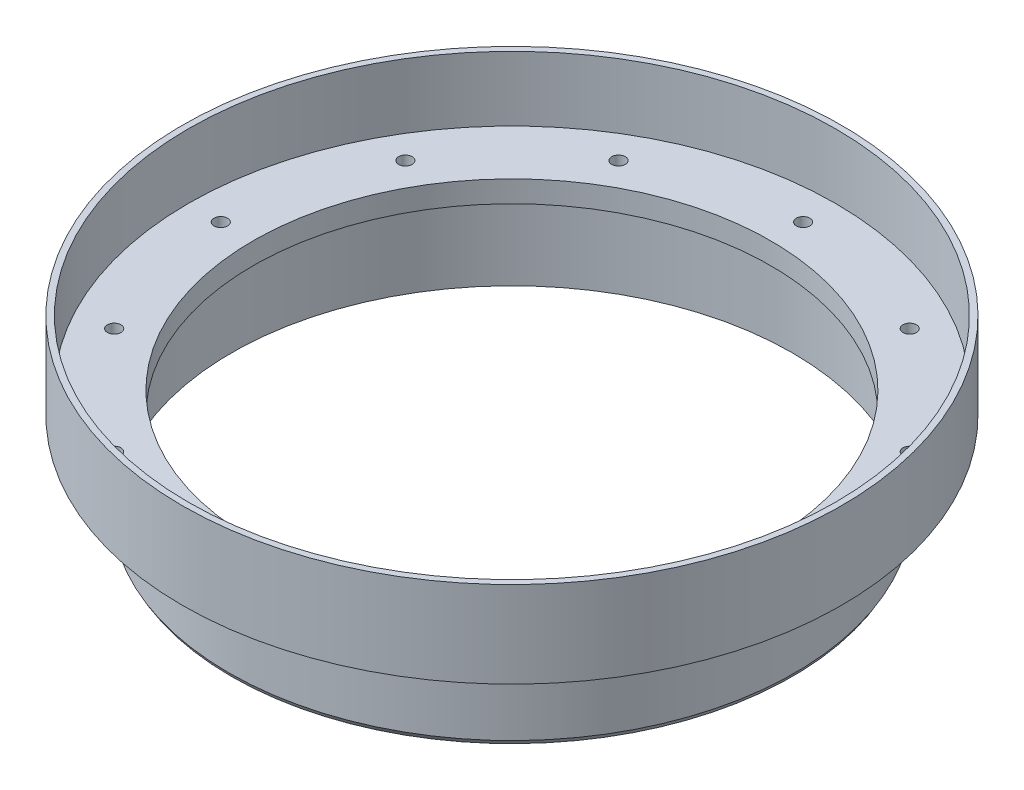
ISO-10303-21;
HEADER;
FILE_DESCRIPTION(('STEP AP214'),'2;1');
FILE_NAME('part.step','',(''),(''),'','','');
FILE_SCHEMA(('AUTOMOTIVE_DESIGN { 1 0 10303 214 1 1 1 1 }'));
ENDSEC;
DATA;
#1=APPLICATION_CONTEXT('core data for automotive mechanical design processes');
#2=APPLICATION_PROTOCOL_DEFINITION('international standard','automotive_design',2000,#1);
#3=PRODUCT_CONTEXT('',#1,'mechanical');
#4=PRODUCT('Part','Part','',(#3));
#5=PRODUCT_RELATED_PRODUCT_CATEGORY('part','',(#4));
#6=PRODUCT_DEFINITION_FORMATION('','',#4);
#7=PRODUCT_DEFINITION_CONTEXT('part definition',#1,'design');
#8=PRODUCT_DEFINITION('design','',#6,#7);
#9=PRODUCT_DEFINITION_SHAPE('','',#8);
#10=(LENGTH_UNIT() NAMED_UNIT(*) SI_UNIT(.MILLI.,.METRE.));
#11=(NAMED_UNIT(*) PLANE_ANGLE_UNIT() SI_UNIT($,.RADIAN.));
#12=(NAMED_UNIT(*) SI_UNIT($,.STERADIAN.) SOLID_ANGLE_UNIT());
#13=UNCERTAINTY_MEASURE_WITH_UNIT(LENGTH_MEASURE(1.E-05),#10,'distance_accuracy_value','');
#14=(GEOMETRIC_REPRESENTATION_CONTEXT(3) GLOBAL_UNCERTAINTY_ASSIGNED_CONTEXT((#13)) GLOBAL_UNIT_ASSIGNED_CONTEXT((#10,
#11,#12)) REPRESENTATION_CONTEXT('',''));
#15=CARTESIAN_POINT('',(0.,0.,0.));
#16=DIRECTION('',(0.,0.,1.));
#17=DIRECTION('',(1.,0.,0.));
#18=AXIS2_PLACEMENT_3D('',#15,#16,#17);
#19=CARTESIAN_POINT('',(-47.625,0.,0.));
#20=DIRECTION('',(0.,1.,0.));
#21=DIRECTION('',(0.,0.,1.));
#22=AXIS2_PLACEMENT_3D('',#19,#20,#21);
#23=PLANE('',#22);
#24=CARTESIAN_POINT('',(-37.1200138697107,0.,21.4312499999996));
#25=DIRECTION('',(0.,1.,0.));
#26=DIRECTION('',(0.,0.,1.));
#27=AXIS2_PLACEMENT_3D('',#24,#25,#26);
#28=CIRCLE('',#27,0.996949999999996);
#29=CARTESIAN_POINT('',(-37.1200138697107,0.,22.4281999999996));
#30=VERTEX_POINT('',#29);
#31=EDGE_CURVE('E143',#30,#30,#28,.T.);
#32=ORIENTED_EDGE('',*,*,#31,.F.);
#33=EDGE_LOOP('',(#32));
#34=FACE_BOUND('',#33,.T.);
#35=CARTESIAN_POINT('',(-21.4312500000004,0.,37.1200138697103));
#36=DIRECTION('',(0.,1.,0.));
#37=DIRECTION('',(0.,0.,1.));
#38=AXIS2_PLACEMENT_3D('',#35,#36,#37);
#39=CIRCLE('',#38,0.99695);
#40=CARTESIAN_POINT('',(-21.4312500000004,0.,38.1169638697103));
#41=VERTEX_POINT('',#40);
#42=EDGE_CURVE('E147',#41,#41,#39,.T.);
#43=ORIENTED_EDGE('',*,*,#42,.F.);
#44=EDGE_LOOP('',(#43));
#45=FACE_BOUND('',#44,.T.);
#46=CARTESIAN_POINT('',(-3.67572619286853E-13,0.,42.8625));
#47=DIRECTION('',(0.,1.,0.));
#48=DIRECTION('',(0.,0.,1.));
#49=AXIS2_PLACEMENT_3D('',#46,#47,#48);
#50=CIRCLE('',#49,0.996949999999999);
#51=CARTESIAN_POINT('',(-3.67572619286853E-13,0.,43.85945));
#52=VERTEX_POINT('',#51);
#53=EDGE_CURVE('E151',#52,#52,#50,.T.);
#54=ORIENTED_EDGE('',*,*,#53,.F.);
#55=EDGE_LOOP('',(#54));
#56=FACE_BOUND('',#55,.T.);
#57=CARTESIAN_POINT('',(21.4312499999997,0.,37.1200138697107));
#58=DIRECTION('',(0.,1.,0.));
#59=DIRECTION('',(0.,0.,1.));
#60=AXIS2_PLACEMENT_3D('',#57,#58,#59);
#61=CIRCLE('',#60,0.99695);
#62=CARTESIAN_POINT('',(21.4312499999997,0.,38.1169638697107));
#63=VERTEX_POINT('',#62);
#64=EDGE_CURVE('E155',#63,#63,#61,.T.);
#65=ORIENTED_EDGE('',*,*,#64,.F.);
#66=EDGE_LOOP('',(#65));
#67=FACE_BOUND('',#66,.T.);
#68=CARTESIAN_POINT('',(37.1200138697104,0.,21.4312500000002));
#69=DIRECTION('',(0.,1.,0.));
#70=DIRECTION('',(0.,0.,1.));
#71=AXIS2_PLACEMENT_3D('',#68,#69,#70);
#72=CIRCLE('',#71,0.996949999999996);
#73=CARTESIAN_POINT('',(37.1200138697104,0.,22.4282000000002));
#74=VERTEX_POINT('',#73);
#75=EDGE_CURVE('E159',#74,#74,#72,.T.);
#76=ORIENTED_EDGE('',*,*,#75,.F.);
#77=EDGE_LOOP('',(#76));
#78=FACE_BOUND('',#77,.T.);
#79=CARTESIAN_POINT('',(42.8625,0.,2.36953774157887E-13));
#80=DIRECTION('',(0.,1.,0.));
#81=DIRECTION('',(0.,0.,1.));
#82=AXIS2_PLACEMENT_3D('',#79,#80,#81);
#83=CIRCLE('',#82,0.996949999999996);
#84=CARTESIAN_POINT('',(42.8625,0.,0.996950000000233));
#85=VERTEX_POINT('',#84);
#86=EDGE_CURVE('E85',#85,#85,#83,.T.);
#87=ORIENTED_EDGE('',*,*,#86,.F.);
#88=EDGE_LOOP('',(#87));
#89=FACE_BOUND('',#88,.T.);
#90=CARTESIAN_POINT('',(37.1200138697106,0.,-21.4312499999998));
#91=DIRECTION('',(0.,1.,0.));
#92=DIRECTION('',(0.,0.,1.));
#93=AXIS2_PLACEMENT_3D('',#90,#91,#92);
#94=CIRCLE('',#93,0.996949999999996);
#95=CARTESIAN_POINT('',(37.1200138697106,0.,-20.4342999999998));
#96=VERTEX_POINT('',#95);
#97=EDGE_CURVE('E74',#96,#96,#94,.T.);
#98=ORIENTED_EDGE('',*,*,#97,.F.);
#99=EDGE_LOOP('',(#98));
#100=FACE_BOUND('',#99,.T.);
#101=CARTESIAN_POINT('',(21.4312500000001,0.,-37.1200138697104));
#102=DIRECTION('',(0.,1.,0.));
#103=DIRECTION('',(0.,0.,1.));
#104=AXIS2_PLACEMENT_3D('',#101,#102,#103);
#105=CIRCLE('',#104,0.99695);
#106=CARTESIAN_POINT('',(21.4312500000001,0.,-36.1230638697104));
#107=VERTEX_POINT('',#106);
#108=EDGE_CURVE('E71',#107,#107,#105,.T.);
#109=ORIENTED_EDGE('',*,*,#108,.F.);
#110=EDGE_LOOP('',(#109));
#111=FACE_BOUND('',#110,.T.);
#112=CARTESIAN_POINT('',(1.15852315907521E-13,0.,-42.8625));
#113=DIRECTION('',(0.,1.,0.));
#114=DIRECTION('',(0.,0.,1.));
#115=AXIS2_PLACEMENT_3D('',#112,#113,#114);
#116=CIRCLE('',#115,0.996949999999999);
#117=CARTESIAN_POINT('',(1.15852315907521E-13,0.,-41.86555));
#118=VERTEX_POINT('',#117);
#119=EDGE_CURVE('E70',#118,#118,#116,.T.);
#120=ORIENTED_EDGE('',*,*,#119,.F.);
#121=EDGE_LOOP('',(#120));
#122=FACE_BOUND('',#121,.T.);
#123=CARTESIAN_POINT('',(-21.4312499999999,0.,-37.1200138697105));
#124=DIRECTION('',(0.,1.,0.));
#125=DIRECTION('',(0.,0.,1.));
#126=AXIS2_PLACEMENT_3D('',#123,#124,#125);
#127=CIRCLE('',#126,0.99695);
#128=CARTESIAN_POINT('',(-21.4312499999999,0.,-36.1230638697105));
#129=VERTEX_POINT('',#128);
#130=EDGE_CURVE('E67',#129,#129,#127,.T.);
#131=ORIENTED_EDGE('',*,*,#130,.F.);
#132=EDGE_LOOP('',(#131));
#133=FACE_BOUND('',#132,.T.);
#134=CARTESIAN_POINT('',(-37.1200138697105,0.,-21.43125));
#135=DIRECTION('',(0.,1.,0.));
#136=DIRECTION('',(0.,0.,1.));
#137=AXIS2_PLACEMENT_3D('',#134,#135,#136);
#138=CIRCLE('',#137,0.996949999999996);
#139=CARTESIAN_POINT('',(-37.1200138697105,0.,-20.4343));
#140=VERTEX_POINT('',#139);
#141=EDGE_CURVE('E63',#140,#140,#138,.T.);
#142=ORIENTED_EDGE('',*,*,#141,.F.);
#143=EDGE_LOOP('',(#142));
#144=FACE_BOUND('',#143,.T.);
#145=CARTESIAN_POINT('',(-42.8625,0.,0.));
#146=DIRECTION('',(0.,1.,0.));
#147=DIRECTION('',(0.,0.,1.));
#148=AXIS2_PLACEMENT_3D('',#145,#146,#147);
#149=CIRCLE('',#148,0.996949999999996);
#150=CARTESIAN_POINT('',(-42.8625,0.,0.996950000000002));
#151=VERTEX_POINT('',#150);
#152=EDGE_CURVE('E59',#151,#151,#149,.T.);
#153=ORIENTED_EDGE('',*,*,#152,.F.);
#154=EDGE_LOOP('',(#153));
#155=FACE_BOUND('',#154,.T.);
#156=CARTESIAN_POINT('',(0.,0.,0.));
#157=DIRECTION('',(0.,1.,0.));
#158=DIRECTION('',(0.,0.,1.));
#159=AXIS2_PLACEMENT_3D('',#156,#157,#158);
#160=CIRCLE('',#159,47.625);
#161=CARTESIAN_POINT('',(0.,0.,47.625));
#162=VERTEX_POINT('',#161);
#163=EDGE_CURVE('E58',#162,#162,#160,.T.);
#164=ORIENTED_EDGE('',*,*,#163,.T.);
#165=EDGE_LOOP('',(#164));
#166=FACE_BOUND('',#165,.T.);
#167=CARTESIAN_POINT('',(0.,0.,0.));
#168=DIRECTION('',(0.,1.,0.));
#169=DIRECTION('',(0.,0.,1.));
#170=AXIS2_PLACEMENT_3D('',#167,#168,#169);
#171=CIRCLE('',#170,38.1);
#172=CARTESIAN_POINT('',(0.,0.,38.1));
#173=VERTEX_POINT('',#172);
#174=EDGE_CURVE('E10',#173,#173,#171,.T.);
#175=ORIENTED_EDGE('',*,*,#174,.F.);
#176=EDGE_LOOP('',(#175));
#177=FACE_BOUND('',#176,.T.);
#178=ADVANCED_FACE('F39',(#34,#45,#56,#67,#78,#89,#100,#111,#122,#133,#144,#155,#166,#177),#23,.T.);
#179=CARTESIAN_POINT('',(0.,55.,0.));
#180=DIRECTION('',(0.,1.,0.));
#181=DIRECTION('',(0.,0.,1.));
#182=AXIS2_PLACEMENT_3D('',#179,#180,#181);
#183=CYLINDRICAL_SURFACE('',#182,38.1);
#184=ORIENTED_EDGE('',*,*,#174,.T.);
#185=EDGE_LOOP('',(#184));
#186=FACE_BOUND('',#185,.T.);
#187=CARTESIAN_POINT('',(0.,-3.175,0.));
#188=DIRECTION('',(0.,1.,0.));
#189=DIRECTION('',(0.,0.,1.));
#190=AXIS2_PLACEMENT_3D('',#187,#188,#189);
#191=CIRCLE('',#190,38.1);
#192=CARTESIAN_POINT('',(0.,-3.175,38.1));
#193=VERTEX_POINT('',#192);
#194=EDGE_CURVE('E46',#193,#193,#191,.T.);
#195=ORIENTED_EDGE('',*,*,#194,.F.);
#196=EDGE_LOOP('',(#195));
#197=FACE_BOUND('',#196,.T.);
#198=ADVANCED_FACE('F127',(#186,#197),#183,.F.);
#199=CARTESIAN_POINT('',(-38.1,-3.175,0.));
#200=DIRECTION('',(0.,-1.,0.));
#201=DIRECTION('',(0.,0.,-1.));
#202=AXIS2_PLACEMENT_3D('',#199,#200,#201);
#203=PLANE('',#202);
#204=ORIENTED_EDGE('',*,*,#194,.T.);
#205=EDGE_LOOP('',(#204));
#206=FACE_BOUND('',#205,.T.);
#207=CARTESIAN_POINT('',(0.,-3.175,0.));
#208=DIRECTION('',(0.,1.,0.));
#209=DIRECTION('',(0.,0.,1.));
#210=AXIS2_PLACEMENT_3D('',#207,#208,#209);
#211=CIRCLE('',#210,41.275);
#212=CARTESIAN_POINT('',(0.,-3.175,41.275));
#213=VERTEX_POINT('',#212);
#214=EDGE_CURVE('E51',#213,#213,#211,.T.);
#215=ORIENTED_EDGE('',*,*,#214,.F.);
#216=EDGE_LOOP('',(#215));
#217=FACE_BOUND('',#216,.T.);
#218=ADVANCED_FACE('F125',(#206,#217),#203,.T.);
#219=CARTESIAN_POINT('',(0.,55.,0.));
#220=DIRECTION('',(0.,1.,0.));
#221=DIRECTION('',(0.,0.,1.));
#222=AXIS2_PLACEMENT_3D('',#219,#220,#221);
#223=CYLINDRICAL_SURFACE('',#222,41.275);
#224=ORIENTED_EDGE('',*,*,#214,.T.);
#225=EDGE_LOOP('',(#224));
#226=FACE_BOUND('',#225,.T.);
#227=CARTESIAN_POINT('',(0.,-15.875,0.));
#228=DIRECTION('',(0.,1.,0.));
#229=DIRECTION('',(0.,0.,1.));
#230=AXIS2_PLACEMENT_3D('',#227,#228,#229);
#231=CIRCLE('',#230,41.275);
#232=CARTESIAN_POINT('',(0.,-15.875,41.275));
#233=VERTEX_POINT('',#232);
#234=EDGE_CURVE('E117',#233,#233,#231,.T.);
#235=ORIENTED_EDGE('',*,*,#234,.F.);
#236=EDGE_LOOP('',(#235));
#237=FACE_BOUND('',#236,.T.);
#238=ADVANCED_FACE('F122',(#226,#237),#223,.F.);
#239=CARTESIAN_POINT('',(0.,-15.2150886423163,0.));
#240=DIRECTION('',(0.,1.,0.));
#241=DIRECTION('',(0.,0.,1.));
#242=AXIS2_PLACEMENT_3D('',#239,#240,#241);
#243=CONICAL_SURFACE('',#242,41.656,0.523598775598298);
#244=ORIENTED_EDGE('',*,*,#234,.T.);
#245=EDGE_LOOP('',(#244));
#246=FACE_BOUND('',#245,.T.);
#247=CARTESIAN_POINT('',(0.,-15.2150886423163,0.));
#248=DIRECTION('',(0.,1.,0.));
#249=DIRECTION('',(0.,0.,1.));
#250=AXIS2_PLACEMENT_3D('',#247,#248,#249);
#251=CIRCLE('',#250,41.656);
#252=CARTESIAN_POINT('',(0.,-15.2150886423163,41.656));
#253=VERTEX_POINT('',#252);
#254=EDGE_CURVE('E114',#253,#253,#251,.T.);
#255=ORIENTED_EDGE('',*,*,#254,.F.);
#256=EDGE_LOOP('',(#255));
#257=FACE_BOUND('',#256,.T.);
#258=ADVANCED_FACE('F134',(#246,#257),#243,.T.);
#259=CARTESIAN_POINT('',(0.,55.,0.));
#260=DIRECTION('',(0.,1.,0.));
#261=DIRECTION('',(0.,0.,1.));
#262=AXIS2_PLACEMENT_3D('',#259,#260,#261);
#263=CYLINDRICAL_SURFACE('',#262,41.656);
#264=ORIENTED_EDGE('',*,*,#254,.T.);
#265=EDGE_LOOP('',(#264));
#266=FACE_BOUND('',#265,.T.);
#267=CARTESIAN_POINT('',(0.,-3.175,0.));
#268=DIRECTION('',(0.,1.,0.));
#269=DIRECTION('',(0.,0.,1.));
#270=AXIS2_PLACEMENT_3D('',#267,#268,#269);
#271=CIRCLE('',#270,41.656);
#272=CARTESIAN_POINT('',(0.,-3.175,41.656));
#273=VERTEX_POINT('',#272);
#274=EDGE_CURVE('E111',#273,#273,#271,.T.);
#275=ORIENTED_EDGE('',*,*,#274,.F.);
#276=EDGE_LOOP('',(#275));
#277=FACE_BOUND('',#276,.T.);
#278=ADVANCED_FACE('F201',(#266,#277),#263,.T.);
#279=CARTESIAN_POINT('',(-41.656,-3.175,0.));
#280=DIRECTION('',(0.,-1.,0.));
#281=DIRECTION('',(0.,0.,-1.));
#282=AXIS2_PLACEMENT_3D('',#279,#280,#281);
#283=PLANE('',#282);
#284=CARTESIAN_POINT('',(-37.1200138697107,-3.175,21.4312499999996));
#285=DIRECTION('',(0.,-1.,0.));
#286=DIRECTION('',(0.,0.,-1.));
#287=AXIS2_PLACEMENT_3D('',#284,#285,#286);
#288=CIRCLE('',#287,0.996949999999996);
#289=CARTESIAN_POINT('',(-37.1200138697107,-3.175,20.4342999999996));
#290=VERTEX_POINT('',#289);
#291=EDGE_CURVE('E445',#290,#290,#288,.T.);
#292=ORIENTED_EDGE('',*,*,#291,.F.);
#293=EDGE_LOOP('',(#292));
#294=FACE_BOUND('',#293,.T.);
#295=CARTESIAN_POINT('',(-21.4312500000004,-3.175,37.1200138697103));
#296=DIRECTION('',(0.,-1.,0.));
#297=DIRECTION('',(0.,0.,-1.));
#298=AXIS2_PLACEMENT_3D('',#295,#296,#297);
#299=CIRCLE('',#298,0.99695);
#300=CARTESIAN_POINT('',(-21.4312500000004,-3.175,36.1230638697103));
#301=VERTEX_POINT('',#300);
#302=EDGE_CURVE('E441',#301,#301,#299,.T.);
#303=ORIENTED_EDGE('',*,*,#302,.F.);
#304=EDGE_LOOP('',(#303));
#305=FACE_BOUND('',#304,.T.);
#306=CARTESIAN_POINT('',(-3.67572619286853E-13,-3.175,42.8625));
#307=DIRECTION('',(0.,-1.,0.));
#308=DIRECTION('',(0.,0.,-1.));
#309=AXIS2_PLACEMENT_3D('',#306,#307,#308);
#310=CIRCLE('',#309,0.996949999999999);
#311=CARTESIAN_POINT('',(-3.67572619286853E-13,-3.175,41.86555));
#312=VERTEX_POINT('',#311);
#313=EDGE_CURVE('E437',#312,#312,#310,.T.);
#314=ORIENTED_EDGE('',*,*,#313,.F.);
#315=EDGE_LOOP('',(#314));
#316=FACE_BOUND('',#315,.T.);
#317=CARTESIAN_POINT('',(21.4312499999997,-3.175,37.1200138697107));
#318=DIRECTION('',(0.,-1.,0.));
#319=DIRECTION('',(0.,0.,-1.));
#320=AXIS2_PLACEMENT_3D('',#317,#318,#319);
#321=CIRCLE('',#320,0.99695);
#322=CARTESIAN_POINT('',(21.4312499999997,-3.175,36.1230638697107));
#323=VERTEX_POINT('',#322);
#324=EDGE_CURVE('E42',#323,#323,#321,.T.);
#325=ORIENTED_EDGE('',*,*,#324,.F.);
#326=EDGE_LOOP('',(#325));
#327=FACE_BOUND('',#326,.T.);
#328=CARTESIAN_POINT('',(37.1200138697104,-3.175,21.4312500000002));
#329=DIRECTION('',(0.,-1.,0.));
#330=DIRECTION('',(0.,0.,-1.));
#331=AXIS2_PLACEMENT_3D('',#328,#329,#330);
#332=CIRCLE('',#331,0.996949999999996);
#333=CARTESIAN_POINT('',(37.1200138697104,-3.175,20.4343000000002));
#334=VERTEX_POINT('',#333);
#335=EDGE_CURVE('E430',#334,#334,#332,.T.);
#336=ORIENTED_EDGE('',*,*,#335,.F.);
#337=EDGE_LOOP('',(#336));
#338=FACE_BOUND('',#337,.T.);
#339=CARTESIAN_POINT('',(42.8625,-3.175,2.36953774157887E-13));
#340=DIRECTION('',(0.,-1.,0.));
#341=DIRECTION('',(0.,0.,-1.));
#342=AXIS2_PLACEMENT_3D('',#339,#340,#341);
#343=CIRCLE('',#342,0.996949999999996);
#344=CARTESIAN_POINT('',(42.8625,-3.175,-0.996949999999759));
#345=VERTEX_POINT('',#344);
#346=EDGE_CURVE('E80',#345,#345,#343,.T.);
#347=ORIENTED_EDGE('',*,*,#346,.F.);
#348=EDGE_LOOP('',(#347));
#349=FACE_BOUND('',#348,.T.);
#350=CARTESIAN_POINT('',(37.1200138697106,-3.175,-21.4312499999998));
#351=DIRECTION('',(0.,-1.,0.));
#352=DIRECTION('',(0.,0.,-1.));
#353=AXIS2_PLACEMENT_3D('',#350,#351,#352);
#354=CIRCLE('',#353,0.996949999999996);
#355=CARTESIAN_POINT('',(37.1200138697106,-3.175,-22.4281999999998));
#356=VERTEX_POINT('',#355);
#357=EDGE_CURVE('E72',#356,#356,#354,.T.);
#358=ORIENTED_EDGE('',*,*,#357,.F.);
#359=EDGE_LOOP('',(#358));
#360=FACE_BOUND('',#359,.T.);
#361=CARTESIAN_POINT('',(21.4312500000001,-3.175,-37.1200138697104));
#362=DIRECTION('',(0.,-1.,0.));
#363=DIRECTION('',(0.,0.,-1.));
#364=AXIS2_PLACEMENT_3D('',#361,#362,#363);
#365=CIRCLE('',#364,0.99695);
#366=CARTESIAN_POINT('',(21.4312500000001,-3.175,-38.1169638697104));
#367=VERTEX_POINT('',#366);
#368=EDGE_CURVE('E68',#367,#367,#365,.T.);
#369=ORIENTED_EDGE('',*,*,#368,.F.);
#370=EDGE_LOOP('',(#369));
#371=FACE_BOUND('',#370,.T.);
#372=CARTESIAN_POINT('',(1.15852315907521E-13,-3.175,-42.8625));
#373=DIRECTION('',(0.,-1.,0.));
#374=DIRECTION('',(0.,0.,-1.));
#375=AXIS2_PLACEMENT_3D('',#372,#373,#374);
#376=CIRCLE('',#375,0.996949999999999);
#377=CARTESIAN_POINT('',(1.15852315907521E-13,-3.175,-43.85945));
#378=VERTEX_POINT('',#377);
#379=EDGE_CURVE('E91',#378,#378,#376,.T.);
#380=ORIENTED_EDGE('',*,*,#379,.F.);
#381=EDGE_LOOP('',(#380));
#382=FACE_BOUND('',#381,.T.);
#383=CARTESIAN_POINT('',(-21.4312499999999,-3.175,-37.1200138697105));
#384=DIRECTION('',(0.,-1.,0.));
#385=DIRECTION('',(0.,0.,-1.));
#386=AXIS2_PLACEMENT_3D('',#383,#384,#385);
#387=CIRCLE('',#386,0.99695);
#388=CARTESIAN_POINT('',(-21.4312499999999,-3.175,-38.1169638697105));
#389=VERTEX_POINT('',#388);
#390=EDGE_CURVE('E64',#389,#389,#387,.T.);
#391=ORIENTED_EDGE('',*,*,#390,.F.);
#392=EDGE_LOOP('',(#391));
#393=FACE_BOUND('',#392,.T.);
#394=CARTESIAN_POINT('',(-37.1200138697105,-3.175,-21.43125));
#395=DIRECTION('',(0.,-1.,0.));
#396=DIRECTION('',(0.,0.,-1.));
#397=AXIS2_PLACEMENT_3D('',#394,#395,#396);
#398=CIRCLE('',#397,0.996949999999996);
#399=CARTESIAN_POINT('',(-37.1200138697105,-3.175,-22.4282));
#400=VERTEX_POINT('',#399);
#401=EDGE_CURVE('E60',#400,#400,#398,.T.);
#402=ORIENTED_EDGE('',*,*,#401,.F.);
#403=EDGE_LOOP('',(#402));
#404=FACE_BOUND('',#403,.T.);
#405=CARTESIAN_POINT('',(-42.8625,-3.175,0.));
#406=DIRECTION('',(0.,-1.,0.));
#407=DIRECTION('',(0.,0.,-1.));
#408=AXIS2_PLACEMENT_3D('',#405,#406,#407);
#409=CIRCLE('',#408,0.996949999999996);
#410=CARTESIAN_POINT('',(-42.8625,-3.175,-0.996949999999991));
#411=VERTEX_POINT('',#410);
#412=EDGE_CURVE('E55',#411,#411,#409,.T.);
#413=ORIENTED_EDGE('',*,*,#412,.F.);
#414=EDGE_LOOP('',(#413));
#415=FACE_BOUND('',#414,.T.);
#416=ORIENTED_EDGE('',*,*,#274,.T.);
#417=EDGE_LOOP('',(#416));
#418=FACE_BOUND('',#417,.T.);
#419=CARTESIAN_POINT('',(0.,-3.175,0.));
#420=DIRECTION('',(0.,1.,0.));
#421=DIRECTION('',(0.,0.,1.));
#422=AXIS2_PLACEMENT_3D('',#419,#420,#421);
#423=CIRCLE('',#422,48.514);
#424=CARTESIAN_POINT('',(0.,-3.175,48.514));
#425=VERTEX_POINT('',#424);
#426=EDGE_CURVE('E108',#425,#425,#423,.T.);
#427=ORIENTED_EDGE('',*,*,#426,.F.);
#428=EDGE_LOOP('',(#427));
#429=FACE_BOUND('',#428,.T.);
#430=ADVANCED_FACE('F197',(#294,#305,#316,#327,#338,#349,#360,#371,#382,#393,#404,#415,#418,
#429),#283,.T.);
#431=CARTESIAN_POINT('',(0.,55.,0.));
#432=DIRECTION('',(0.,1.,0.));
#433=DIRECTION('',(0.,0.,1.));
#434=AXIS2_PLACEMENT_3D('',#431,#432,#433);
#435=CYLINDRICAL_SURFACE('',#434,48.514);
#436=ORIENTED_EDGE('',*,*,#426,.T.);
#437=EDGE_LOOP('',(#436));
#438=FACE_BOUND('',#437,.T.);
#439=CARTESIAN_POINT('',(0.,9.525,0.));
#440=DIRECTION('',(0.,1.,0.));
#441=DIRECTION('',(0.,0.,1.));
#442=AXIS2_PLACEMENT_3D('',#439,#440,#441);
#443=CIRCLE('',#442,48.514);
#444=CARTESIAN_POINT('',(0.,9.525,48.514));
#445=VERTEX_POINT('',#444);
#446=EDGE_CURVE('E105',#445,#445,#443,.T.);
#447=ORIENTED_EDGE('',*,*,#446,.F.);
#448=EDGE_LOOP('',(#447));
#449=FACE_BOUND('',#448,.T.);
#450=ADVANCED_FACE('F190',(#438,#449),#435,.T.);
#451=CARTESIAN_POINT('',(-48.514,9.525,0.));
#452=DIRECTION('',(0.,1.,0.));
#453=DIRECTION('',(0.,0.,1.));
#454=AXIS2_PLACEMENT_3D('',#451,#452,#453);
#455=PLANE('',#454);
#456=ORIENTED_EDGE('',*,*,#446,.T.);
#457=EDGE_LOOP('',(#456));
#458=FACE_BOUND('',#457,.T.);
#459=CARTESIAN_POINT('',(0.,9.525,0.));
#460=DIRECTION('',(0.,1.,0.));
#461=DIRECTION('',(0.,0.,1.));
#462=AXIS2_PLACEMENT_3D('',#459,#460,#461);
#463=CIRCLE('',#462,47.625);
#464=CARTESIAN_POINT('',(0.,9.525,47.625));
#465=VERTEX_POINT('',#464);
#466=EDGE_CURVE('E102',#465,#465,#463,.T.);
#467=ORIENTED_EDGE('',*,*,#466,.F.);
#468=EDGE_LOOP('',(#467));
#469=FACE_BOUND('',#468,.T.);
#470=ADVANCED_FACE('F180',(#458,#469),#455,.T.);
#471=CARTESIAN_POINT('',(0.,55.,0.));
#472=DIRECTION('',(0.,1.,0.));
#473=DIRECTION('',(0.,0.,1.));
#474=AXIS2_PLACEMENT_3D('',#471,#472,#473);
#475=CYLINDRICAL_SURFACE('',#474,47.625);
#476=ORIENTED_EDGE('',*,*,#466,.T.);
#477=EDGE_LOOP('',(#476));
#478=FACE_BOUND('',#477,.T.);
#479=ORIENTED_EDGE('',*,*,#163,.F.);
#480=EDGE_LOOP('',(#479));
#481=FACE_BOUND('',#480,.T.);
#482=ADVANCED_FACE('F177',(#478,#481),#475,.F.);
#483=CARTESIAN_POINT('',(-42.8625,0.,0.));
#484=DIRECTION('',(0.,1.,0.));
#485=DIRECTION('',(0.,0.,1.));
#486=AXIS2_PLACEMENT_3D('',#483,#484,#485);
#487=CYLINDRICAL_SURFACE('',#486,0.996949999999996);
#488=ORIENTED_EDGE('',*,*,#412,.T.);
#489=EDGE_LOOP('',(#488));
#490=FACE_BOUND('',#489,.T.);
#491=ORIENTED_EDGE('',*,*,#152,.T.);
#492=EDGE_LOOP('',(#491));
#493=FACE_BOUND('',#492,.T.);
#494=ADVANCED_FACE('F179',(#490,#493),#487,.F.);
#495=CARTESIAN_POINT('',(-37.1200138697105,0.,-21.43125));
#496=DIRECTION('',(0.,1.,0.));
#497=DIRECTION('',(0.,0.,1.));
#498=AXIS2_PLACEMENT_3D('',#495,#496,#497);
#499=CYLINDRICAL_SURFACE('',#498,0.996949999999996);
#500=ORIENTED_EDGE('',*,*,#401,.T.);
#501=EDGE_LOOP('',(#500));
#502=FACE_BOUND('',#501,.T.);
#503=ORIENTED_EDGE('',*,*,#141,.T.);
#504=EDGE_LOOP('',(#503));
#505=FACE_BOUND('',#504,.T.);
#506=ADVANCED_FACE('F187',(#502,#505),#499,.F.);
#507=CARTESIAN_POINT('',(-21.4312499999999,0.,-37.1200138697105));
#508=DIRECTION('',(0.,1.,0.));
#509=DIRECTION('',(0.,0.,1.));
#510=AXIS2_PLACEMENT_3D('',#507,#508,#509);
#511=CYLINDRICAL_SURFACE('',#510,0.99695);
#512=ORIENTED_EDGE('',*,*,#390,.T.);
#513=EDGE_LOOP('',(#512));
#514=FACE_BOUND('',#513,.T.);
#515=ORIENTED_EDGE('',*,*,#130,.T.);
#516=EDGE_LOOP('',(#515));
#517=FACE_BOUND('',#516,.T.);
#518=ADVANCED_FACE('F302',(#514,#517),#511,.F.);
#519=CARTESIAN_POINT('',(1.15852315907521E-13,0.,-42.8625));
#520=DIRECTION('',(0.,1.,0.));
#521=DIRECTION('',(0.,0.,1.));
#522=AXIS2_PLACEMENT_3D('',#519,#520,#521);
#523=CYLINDRICAL_SURFACE('',#522,0.996949999999999);
#524=ORIENTED_EDGE('',*,*,#379,.T.);
#525=EDGE_LOOP('',(#524));
#526=FACE_BOUND('',#525,.T.);
#527=ORIENTED_EDGE('',*,*,#119,.T.);
#528=EDGE_LOOP('',(#527));
#529=FACE_BOUND('',#528,.T.);
#530=ADVANCED_FACE('F341',(#526,#529),#523,.F.);
#531=CARTESIAN_POINT('',(21.4312500000001,0.,-37.1200138697104));
#532=DIRECTION('',(0.,1.,0.));
#533=DIRECTION('',(0.,0.,1.));
#534=AXIS2_PLACEMENT_3D('',#531,#532,#533);
#535=CYLINDRICAL_SURFACE('',#534,0.99695);
#536=ORIENTED_EDGE('',*,*,#368,.T.);
#537=EDGE_LOOP('',(#536));
#538=FACE_BOUND('',#537,.T.);
#539=ORIENTED_EDGE('',*,*,#108,.T.);
#540=EDGE_LOOP('',(#539));
#541=FACE_BOUND('',#540,.T.);
#542=ADVANCED_FACE('F330',(#538,#541),#535,.F.);
#543=CARTESIAN_POINT('',(37.1200138697106,0.,-21.4312499999998));
#544=DIRECTION('',(0.,1.,0.));
#545=DIRECTION('',(0.,0.,1.));
#546=AXIS2_PLACEMENT_3D('',#543,#544,#545);
#547=CYLINDRICAL_SURFACE('',#546,0.996949999999996);
#548=ORIENTED_EDGE('',*,*,#357,.T.);
#549=EDGE_LOOP('',(#548));
#550=FACE_BOUND('',#549,.T.);
#551=ORIENTED_EDGE('',*,*,#97,.T.);
#552=EDGE_LOOP('',(#551));
#553=FACE_BOUND('',#552,.T.);
#554=ADVANCED_FACE('F324',(#550,#553),#547,.F.);
#555=CARTESIAN_POINT('',(42.8625,0.,2.36953774157887E-13));
#556=DIRECTION('',(0.,1.,0.));
#557=DIRECTION('',(0.,0.,1.));
#558=AXIS2_PLACEMENT_3D('',#555,#556,#557);
#559=CYLINDRICAL_SURFACE('',#558,0.996949999999996);
#560=ORIENTED_EDGE('',*,*,#346,.T.);
#561=EDGE_LOOP('',(#560));
#562=FACE_BOUND('',#561,.T.);
#563=ORIENTED_EDGE('',*,*,#86,.T.);
#564=EDGE_LOOP('',(#563));
#565=FACE_BOUND('',#564,.T.);
#566=ADVANCED_FACE('F329',(#562,#565),#559,.F.);
#567=CARTESIAN_POINT('',(37.1200138697104,0.,21.4312500000002));
#568=DIRECTION('',(0.,1.,0.));
#569=DIRECTION('',(0.,0.,1.));
#570=AXIS2_PLACEMENT_3D('',#567,#568,#569);
#571=CYLINDRICAL_SURFACE('',#570,0.996949999999996);
#572=ORIENTED_EDGE('',*,*,#335,.T.);
#573=EDGE_LOOP('',(#572));
#574=FACE_BOUND('',#573,.T.);
#575=ORIENTED_EDGE('',*,*,#75,.T.);
#576=EDGE_LOOP('',(#575));
#577=FACE_BOUND('',#576,.T.);
#578=ADVANCED_FACE('F314',(#574,#577),#571,.F.);
#579=CARTESIAN_POINT('',(21.4312499999997,0.,37.1200138697107));
#580=DIRECTION('',(0.,1.,0.));
#581=DIRECTION('',(0.,0.,1.));
#582=AXIS2_PLACEMENT_3D('',#579,#580,#581);
#583=CYLINDRICAL_SURFACE('',#582,0.99695);
#584=ORIENTED_EDGE('',*,*,#324,.T.);
#585=EDGE_LOOP('',(#584));
#586=FACE_BOUND('',#585,.T.);
#587=ORIENTED_EDGE('',*,*,#64,.T.);
#588=EDGE_LOOP('',(#587));
#589=FACE_BOUND('',#588,.T.);
#590=ADVANCED_FACE('F308',(#586,#589),#583,.F.);
#591=CARTESIAN_POINT('',(-3.67572619286853E-13,0.,42.8625));
#592=DIRECTION('',(0.,1.,0.));
#593=DIRECTION('',(0.,0.,1.));
#594=AXIS2_PLACEMENT_3D('',#591,#592,#593);
#595=CYLINDRICAL_SURFACE('',#594,0.996949999999999);
#596=ORIENTED_EDGE('',*,*,#313,.T.);
#597=EDGE_LOOP('',(#596));
#598=FACE_BOUND('',#597,.T.);
#599=ORIENTED_EDGE('',*,*,#53,.T.);
#600=EDGE_LOOP('',(#599));
#601=FACE_BOUND('',#600,.T.);
#602=ADVANCED_FACE('F313',(#598,#601),#595,.F.);
#603=CARTESIAN_POINT('',(-21.4312500000004,0.,37.1200138697103));
#604=DIRECTION('',(0.,1.,0.));
#605=DIRECTION('',(0.,0.,1.));
#606=AXIS2_PLACEMENT_3D('',#603,#604,#605);
#607=CYLINDRICAL_SURFACE('',#606,0.99695);
#608=ORIENTED_EDGE('',*,*,#302,.T.);
#609=EDGE_LOOP('',(#608));
#610=FACE_BOUND('',#609,.T.);
#611=ORIENTED_EDGE('',*,*,#42,.T.);
#612=EDGE_LOOP('',(#611));
#613=FACE_BOUND('',#612,.T.);
#614=ADVANCED_FACE('F291',(#610,#613),#607,.F.);
#615=CARTESIAN_POINT('',(-37.1200138697107,0.,21.4312499999996));
#616=DIRECTION('',(0.,1.,0.));
#617=DIRECTION('',(0.,0.,1.));
#618=AXIS2_PLACEMENT_3D('',#615,#616,#617);
#619=CYLINDRICAL_SURFACE('',#618,0.996949999999996);
#620=ORIENTED_EDGE('',*,*,#291,.T.);
#621=EDGE_LOOP('',(#620));
#622=FACE_BOUND('',#621,.T.);
#623=ORIENTED_EDGE('',*,*,#31,.T.);
#624=EDGE_LOOP('',(#623));
#625=FACE_BOUND('',#624,.T.);
#626=ADVANCED_FACE('F286',(#622,#625),#619,.F.);
#627=CLOSED_SHELL('',(#178,#198,#218,#238,#258,#278,#430,#450,#470,#482,#494,#506,#518,#530,
#542,#554,#566,#578,#590,#602,#614,#626));
#628=MANIFOLD_SOLID_BREP('B2',#627);
#629=ADVANCED_BREP_SHAPE_REPRESENTATION('',(#18,#628),#14);
#630=SHAPE_DEFINITION_REPRESENTATION(#9,#629);
ENDSEC;
END-ISO-10303-21;
